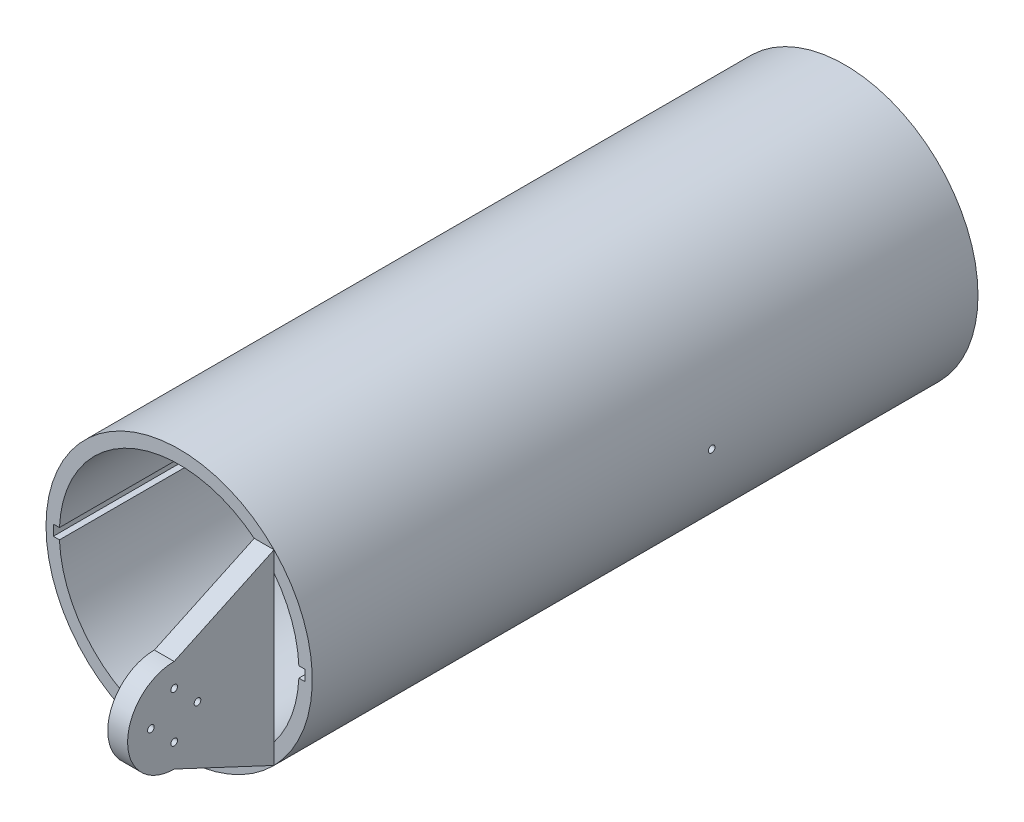
ISO-10303-21;
HEADER;
FILE_DESCRIPTION(('STEP AP214'),'2;1');
FILE_NAME('part.step','',(''),(''),'','','');
FILE_SCHEMA(('AUTOMOTIVE_DESIGN { 1 0 10303 214 1 1 1 1 }'));
ENDSEC;
DATA;
#1=APPLICATION_CONTEXT('core data for automotive mechanical design processes');
#2=APPLICATION_PROTOCOL_DEFINITION('international standard','automotive_design',2000,#1);
#3=PRODUCT_CONTEXT('',#1,'mechanical');
#4=PRODUCT('Part','Part','',(#3));
#5=PRODUCT_RELATED_PRODUCT_CATEGORY('part','',(#4));
#6=PRODUCT_DEFINITION_FORMATION('','',#4);
#7=PRODUCT_DEFINITION_CONTEXT('part definition',#1,'design');
#8=PRODUCT_DEFINITION('design','',#6,#7);
#9=PRODUCT_DEFINITION_SHAPE('','',#8);
#10=(LENGTH_UNIT() NAMED_UNIT(*) SI_UNIT(.MILLI.,.METRE.));
#11=(NAMED_UNIT(*) PLANE_ANGLE_UNIT() SI_UNIT($,.RADIAN.));
#12=(NAMED_UNIT(*) SI_UNIT($,.STERADIAN.) SOLID_ANGLE_UNIT());
#13=UNCERTAINTY_MEASURE_WITH_UNIT(LENGTH_MEASURE(1.E-05),#10,'distance_accuracy_value','');
#14=(GEOMETRIC_REPRESENTATION_CONTEXT(3) GLOBAL_UNCERTAINTY_ASSIGNED_CONTEXT((#13)) GLOBAL_UNIT_ASSIGNED_CONTEXT((#10,
#11,#12)) REPRESENTATION_CONTEXT('',''));
#15=CARTESIAN_POINT('',(0.,0.,0.));
#16=DIRECTION('',(0.,0.,1.));
#17=DIRECTION('',(1.,0.,0.));
#18=AXIS2_PLACEMENT_3D('',#15,#16,#17);
#19=CARTESIAN_POINT('',(0.,0.,250.));
#20=DIRECTION('',(0.,0.,-1.));
#21=DIRECTION('',(-1.,0.,0.));
#22=AXIS2_PLACEMENT_3D('',#19,#20,#21);
#23=CYLINDRICAL_SURFACE('',#22,50.);
#24=CARTESIAN_POINT('',(50.,0.,101.25));
#25=CARTESIAN_POINT('',(49.9999997892433,-0.0702012806053509,101.249996890468));
#26=CARTESIAN_POINT('',(49.9998505669129,-0.140453184521729,101.244066287815));
#27=CARTESIAN_POINT('',(49.9992696347054,-0.279021411192673,101.220490687249));
#28=CARTESIAN_POINT('',(49.9988375866143,-0.347335314234984,101.202831663669));
#29=CARTESIAN_POINT('',(49.9977399359377,-0.480000032970664,101.156302971443));
#30=CARTESIAN_POINT('',(49.9970744467966,-0.544352755839818,101.127438747421));
#31=CARTESIAN_POINT('',(49.9955849996606,-0.66728119145738,101.059326712717));
#32=CARTESIAN_POINT('',(49.9947610805834,-0.725858317628449,101.020081451217));
#33=CARTESIAN_POINT('',(49.9930472282989,-0.835612011829375,100.932304373999));
#34=CARTESIAN_POINT('',(49.9921572753778,-0.886786356266493,100.883769778147));
#35=CARTESIAN_POINT('',(49.9904118342181,-0.980263255157657,100.778796235128));
#36=CARTESIAN_POINT('',(49.9895563473475,-1.02256545779515,100.722356974657));
#37=CARTESIAN_POINT('',(49.9879762331022,-1.09709940400727,100.603169665472));
#38=CARTESIAN_POINT('',(49.9872516204449,-1.12933001528882,100.540420908464));
#39=CARTESIAN_POINT('',(49.9860151168566,-1.1827984149725,100.410400905536));
#40=CARTESIAN_POINT('',(49.9855032252025,-1.20403624074213,100.343129674991));
#41=CARTESIAN_POINT('',(49.9847500083149,-1.23491198038136,100.205989232804));
#42=CARTESIAN_POINT('',(49.9845086262981,-1.24455232873584,100.136120569578));
#43=CARTESIAN_POINT('',(49.9843234739843,-1.25196695086035,99.9957562161149));
#44=CARTESIAN_POINT('',(49.9843797026986,-1.24974126405586,99.925260527962));
#45=CARTESIAN_POINT('',(49.9847833781213,-1.23348907585994,99.7856597612978));
#46=CARTESIAN_POINT('',(49.9851307597476,-1.21946521174131,99.7165543755436));
#47=CARTESIAN_POINT('',(49.9860774771185,-1.18001883030617,99.5816790450587));
#48=CARTESIAN_POINT('',(49.9866768133296,-1.15459629188151,99.5159091065049));
#49=CARTESIAN_POINT('',(49.9880599499198,-1.09307119196166,99.3895631952896));
#50=CARTESIAN_POINT('',(49.988843771187,-1.0569674209775,99.3289878118357));
#51=CARTESIAN_POINT('',(49.9905074926856,-0.975105623991352,99.21475701138));
#52=CARTESIAN_POINT('',(49.9913873930577,-0.929347583862107,99.1611016045044));
#53=CARTESIAN_POINT('',(49.9931443684604,-0.829461225210461,99.0622184655441));
#54=CARTESIAN_POINT('',(49.9940214426512,-0.775330617915762,99.0169930454051));
#55=CARTESIAN_POINT('',(49.9956736570713,-0.660243785237119,98.9362714726598));
#56=CARTESIAN_POINT('',(49.9964487972851,-0.599287558820383,98.9007753215255));
#57=CARTESIAN_POINT('',(49.9978097681651,-0.472278559451485,98.8405201705382));
#58=CARTESIAN_POINT('',(49.9983955975763,-0.406225752717142,98.8157612418629));
#59=CARTESIAN_POINT('',(49.9993118852416,-0.270899185047347,98.7776848280001));
#60=CARTESIAN_POINT('',(49.9996423439818,-0.201625430244547,98.7643673210292));
#61=CARTESIAN_POINT('',(50.0000105760241,-0.0618435041436848,98.7495546188588));
#62=CARTESIAN_POINT('',(50.0000484285156,0.00866432799248807,98.7480562249943));
#63=CARTESIAN_POINT('',(49.999827390649,0.148930569407979,98.7569159498476));
#64=CARTESIAN_POINT('',(49.9995685005257,0.218688979279795,98.7672740591908));
#65=CARTESIAN_POINT('',(49.9987832089567,0.355467259085124,98.7995501119755));
#66=CARTESIAN_POINT('',(49.9982568410845,0.422487471571989,98.8214666046421));
#67=CARTESIAN_POINT('',(49.9969959169746,0.551897387208432,98.876235815335));
#68=CARTESIAN_POINT('',(49.9962613604543,0.614287084075191,98.9090885481995));
#69=CARTESIAN_POINT('',(49.9946666309293,0.732679665489656,98.9848059046364));
#70=CARTESIAN_POINT('',(49.9938064309167,0.788681172235662,99.0276726819793));
#71=CARTESIAN_POINT('',(49.9920574600653,0.892693853571702,99.1221981272366));
#72=CARTESIAN_POINT('',(49.9911686891723,0.940705013006051,99.1738568118267));
#73=CARTESIAN_POINT('',(49.9894625477771,1.02738478773992,99.2845133569773));
#74=CARTESIAN_POINT('',(49.9886451930737,1.06605133914107,99.3435128345125));
#75=CARTESIAN_POINT('',(49.9871742851885,1.13293016503026,99.467167887786));
#76=CARTESIAN_POINT('',(49.9865207316976,1.16114245925612,99.5318234528452));
#77=CARTESIAN_POINT('',(49.9854512245261,1.20630831809067,99.6649475530868));
#78=CARTESIAN_POINT('',(49.9850352425774,1.22326322223585,99.7334156335601));
#79=CARTESIAN_POINT('',(49.9844876991685,1.24543740915402,99.8722276845196));
#80=CARTESIAN_POINT('',(49.9843561376915,1.25065669262368,99.9425716548945));
#81=CARTESIAN_POINT('',(49.9843922787728,1.24921131303956,100.08311792715));
#82=CARTESIAN_POINT('',(49.9845598992096,1.242549911081,100.153320262613));
#83=CARTESIAN_POINT('',(49.985175335134,1.21753894538223,100.291609864828));
#84=CARTESIAN_POINT('',(49.98562315118,1.19918935835732,100.359697127367));
#85=CARTESIAN_POINT('',(49.986748485414,1.15132321438058,100.49182541808));
#86=CARTESIAN_POINT('',(49.9874260076321,1.12180646151248,100.555866375244));
#87=CARTESIAN_POINT('',(49.9889343430816,1.05244537142006,100.678082151641));
#88=CARTESIAN_POINT('',(49.9897651506242,1.01260141744787,100.736257188454));
#89=CARTESIAN_POINT('',(49.9914866049636,0.92370883247783,100.845103812792));
#90=CARTESIAN_POINT('',(49.992377261793,0.874658655736825,100.895774137701));
#91=CARTESIAN_POINT('',(49.994118137793,0.768733478143212,100.988174453478));
#92=CARTESIAN_POINT('',(49.9949683468844,0.711856540554558,101.02990222495));
#93=CARTESIAN_POINT('',(49.9965327264857,0.591873911934435,101.103237927888));
#94=CARTESIAN_POINT('',(49.9972468156398,0.528764529907139,101.134839814985));
#95=CARTESIAN_POINT('',(49.998456932991,0.398183073403346,101.186962967462));
#96=CARTESIAN_POINT('',(49.9989532215103,0.330716318304683,101.207497467673));
#97=CARTESIAN_POINT('',(49.999538941339,0.219018516921423,101.231451616862));
#98=CARTESIAN_POINT('',(49.9997110897919,0.175512722018037,101.238398530281));
#99=CARTESIAN_POINT('',(49.9999416851822,0.0880112516517628,101.247673696205));
#100=CARTESIAN_POINT('',(50.0000001321426,0.0440155762883697,101.250001949649));
#101=CARTESIAN_POINT('',(50.,0.,101.25));
#102=B_SPLINE_CURVE_WITH_KNOTS('',3,(#24,#25,#26,#27,#28,#29,#30,#31,#32,#33,#34,#35,#36,#37,
#38,#39,#40,#41,#42,#43,#44,#45,#46,#47,#48,#49,#50,#51,#52,#53,#54,#55,#56,#57,#58,#59,#60,#61,
#62,#63,#64,#65,#66,#67,#68,#69,#70,#71,#72,#73,#74,#75,#76,#77,#78,#79,#80,#81,#82,#83,#84,#85,
#86,#87,#88,#89,#90,#91,#92,#93,#94,#95,#96,#97,#98,#99,#100,#101),.UNSPECIFIED.,.T.,.F.,(4,2,2,
2,2,2,2,2,2,2,2,2,2,2,2,2,2,2,2,2,2,2,2,2,2,2,2,2,2,2,2,2,2,2,2,2,2,2,4),(0.,0.210443181033347,
0.421138479019948,0.631731527740004,0.842272910862806,1.05287740411288,1.26349024711038,
1.47412675962819,1.68476255612964,1.89535412929105,2.10594500275222,2.31648881487096,
2.52703301687766,2.73760106897999,2.94816942921227,3.15879545366897,3.36942150999579,
3.58004896255672,3.79067601410156,4.00124606064959,4.21181594070732,4.42235939693014,
4.63290313881923,4.84349220516216,5.05408167093516,5.26471760616385,5.47535314370606,
5.68596361286427,5.89657406951998,6.10712672521302,6.3176798003613,6.5282365696147,
6.73878552602708,6.94936986570474,7.16000640860575,7.37076845199211,7.58127789517965,
7.71322391796614,7.84516991395463),.UNSPECIFIED.);
#103=CARTESIAN_POINT('',(50.,0.,101.25));
#104=VERTEX_POINT('',#103);
#105=EDGE_CURVE('E221',#104,#104,#102,.T.);
#106=ORIENTED_EDGE('',*,*,#105,.F.);
#107=EDGE_LOOP('',(#106));
#108=FACE_BOUND('',#107,.T.);
#109=CARTESIAN_POINT('',(0.,0.,250.));
#110=DIRECTION('',(0.,0.,1.));
#111=DIRECTION('',(1.,0.,0.));
#112=AXIS2_PLACEMENT_3D('',#109,#110,#111);
#113=CIRCLE('',#112,50.);
#114=CARTESIAN_POINT('',(35.6404264845415,35.0679340708858,250.));
#115=VERTEX_POINT('',#114);
#116=CARTESIAN_POINT('',(35.6404264845415,-35.0679340708858,250.));
#117=VERTEX_POINT('',#116);
#118=EDGE_CURVE('E132',#115,#117,#113,.T.);
#119=ORIENTED_EDGE('',*,*,#118,.F.);
#120=EDGE_CURVE('E142',#117,#115,#113,.T.);
#121=ORIENTED_EDGE('',*,*,#120,.F.);
#122=EDGE_LOOP('',(#119,#121));
#123=FACE_BOUND('',#122,.T.);
#124=CARTESIAN_POINT('',(0.,0.,0.));
#125=DIRECTION('',(0.,0.,1.));
#126=DIRECTION('',(1.,0.,0.));
#127=AXIS2_PLACEMENT_3D('',#124,#125,#126);
#128=CIRCLE('',#127,50.);
#129=CARTESIAN_POINT('',(50.,0.,0.));
#130=VERTEX_POINT('',#129);
#131=EDGE_CURVE('E174',#130,#130,#128,.T.);
#132=ORIENTED_EDGE('',*,*,#131,.T.);
#133=EDGE_LOOP('',(#132));
#134=FACE_BOUND('',#133,.T.);
#135=CARTESIAN_POINT('',(-50.,0.,101.25));
#136=CARTESIAN_POINT('',(-49.9999997892433,0.0702012806053509,101.249996890468));
#137=CARTESIAN_POINT('',(-49.9998505669129,0.140453184521729,101.244066287815));
#138=CARTESIAN_POINT('',(-49.9992696347054,0.279021411192673,101.220490687249));
#139=CARTESIAN_POINT('',(-49.9988375866143,0.347335314234984,101.202831663669));
#140=CARTESIAN_POINT('',(-49.9977399359377,0.480000032970664,101.156302971443));
#141=CARTESIAN_POINT('',(-49.9970744467966,0.544352755839818,101.127438747421));
#142=CARTESIAN_POINT('',(-49.9955849996606,0.66728119145738,101.059326712717));
#143=CARTESIAN_POINT('',(-49.9947610805834,0.725858317628449,101.020081451217));
#144=CARTESIAN_POINT('',(-49.9930472282989,0.835612011829375,100.932304373999));
#145=CARTESIAN_POINT('',(-49.9921572753778,0.886786356266493,100.883769778147));
#146=CARTESIAN_POINT('',(-49.9904118342181,0.980263255157657,100.778796235128));
#147=CARTESIAN_POINT('',(-49.9895563473475,1.02256545779515,100.722356974657));
#148=CARTESIAN_POINT('',(-49.9879762331022,1.09709940400727,100.603169665472));
#149=CARTESIAN_POINT('',(-49.9872516204449,1.12933001528882,100.540420908464));
#150=CARTESIAN_POINT('',(-49.9860151168566,1.1827984149725,100.410400905536));
#151=CARTESIAN_POINT('',(-49.9855032252025,1.20403624074213,100.343129674991));
#152=CARTESIAN_POINT('',(-49.9847500083149,1.23491198038136,100.205989232804));
#153=CARTESIAN_POINT('',(-49.9845086262981,1.24455232873584,100.136120569578));
#154=CARTESIAN_POINT('',(-49.9843234739843,1.25196695086035,99.9957562161149));
#155=CARTESIAN_POINT('',(-49.9843797026986,1.24974126405586,99.925260527962));
#156=CARTESIAN_POINT('',(-49.9847833781213,1.23348907585994,99.7856597612978));
#157=CARTESIAN_POINT('',(-49.9851307597476,1.21946521174131,99.7165543755436));
#158=CARTESIAN_POINT('',(-49.9860774771185,1.18001883030617,99.5816790450587));
#159=CARTESIAN_POINT('',(-49.9866768133296,1.15459629188151,99.5159091065049));
#160=CARTESIAN_POINT('',(-49.9880599499198,1.09307119196166,99.3895631952896));
#161=CARTESIAN_POINT('',(-49.988843771187,1.0569674209775,99.3289878118357));
#162=CARTESIAN_POINT('',(-49.9905074926856,0.975105623991352,99.21475701138));
#163=CARTESIAN_POINT('',(-49.9913873930577,0.929347583862107,99.1611016045044));
#164=CARTESIAN_POINT('',(-49.9931443684604,0.829461225210461,99.0622184655441));
#165=CARTESIAN_POINT('',(-49.9940214426512,0.775330617915762,99.0169930454051));
#166=CARTESIAN_POINT('',(-49.9956736570713,0.660243785237119,98.9362714726598));
#167=CARTESIAN_POINT('',(-49.9964487972851,0.599287558820383,98.9007753215255));
#168=CARTESIAN_POINT('',(-49.9978097681651,0.472278559451485,98.8405201705382));
#169=CARTESIAN_POINT('',(-49.9983955975763,0.406225752717142,98.8157612418629));
#170=CARTESIAN_POINT('',(-49.9993118852416,0.270899185047347,98.7776848280001));
#171=CARTESIAN_POINT('',(-49.9996423439818,0.201625430244547,98.7643673210292));
#172=CARTESIAN_POINT('',(-50.0000105760241,0.0618435041436848,98.7495546188588));
#173=CARTESIAN_POINT('',(-50.0000484285156,-0.00866432799248807,98.7480562249943));
#174=CARTESIAN_POINT('',(-49.999827390649,-0.148930569407979,98.7569159498476));
#175=CARTESIAN_POINT('',(-49.9995685005257,-0.218688979279795,98.7672740591908));
#176=CARTESIAN_POINT('',(-49.9987832089567,-0.355467259085124,98.7995501119755));
#177=CARTESIAN_POINT('',(-49.9982568410845,-0.422487471571989,98.8214666046421));
#178=CARTESIAN_POINT('',(-49.9969959169746,-0.551897387208432,98.876235815335));
#179=CARTESIAN_POINT('',(-49.9962613604543,-0.614287084075191,98.9090885481995));
#180=CARTESIAN_POINT('',(-49.9946666309293,-0.732679665489656,98.9848059046364));
#181=CARTESIAN_POINT('',(-49.9938064309167,-0.788681172235662,99.0276726819793));
#182=CARTESIAN_POINT('',(-49.9920574600653,-0.892693853571702,99.1221981272366));
#183=CARTESIAN_POINT('',(-49.9911686891723,-0.940705013006051,99.1738568118267));
#184=CARTESIAN_POINT('',(-49.9894625477771,-1.02738478773992,99.2845133569773));
#185=CARTESIAN_POINT('',(-49.9886451930737,-1.06605133914107,99.3435128345125));
#186=CARTESIAN_POINT('',(-49.9871742851885,-1.13293016503026,99.467167887786));
#187=CARTESIAN_POINT('',(-49.9865207316976,-1.16114245925612,99.5318234528452));
#188=CARTESIAN_POINT('',(-49.9854512245261,-1.20630831809067,99.6649475530868));
#189=CARTESIAN_POINT('',(-49.9850352425774,-1.22326322223585,99.7334156335601));
#190=CARTESIAN_POINT('',(-49.9844876991685,-1.24543740915402,99.8722276845196));
#191=CARTESIAN_POINT('',(-49.9843561376915,-1.25065669262368,99.9425716548945));
#192=CARTESIAN_POINT('',(-49.9843922787728,-1.24921131303956,100.08311792715));
#193=CARTESIAN_POINT('',(-49.9845598992096,-1.242549911081,100.153320262613));
#194=CARTESIAN_POINT('',(-49.985175335134,-1.21753894538223,100.291609864828));
#195=CARTESIAN_POINT('',(-49.98562315118,-1.19918935835732,100.359697127367));
#196=CARTESIAN_POINT('',(-49.986748485414,-1.15132321438058,100.49182541808));
#197=CARTESIAN_POINT('',(-49.9874260076321,-1.12180646151248,100.555866375244));
#198=CARTESIAN_POINT('',(-49.9889343430816,-1.05244537142006,100.678082151641));
#199=CARTESIAN_POINT('',(-49.9897651506242,-1.01260141744787,100.736257188454));
#200=CARTESIAN_POINT('',(-49.9914866049636,-0.92370883247783,100.845103812792));
#201=CARTESIAN_POINT('',(-49.992377261793,-0.874658655736825,100.895774137701));
#202=CARTESIAN_POINT('',(-49.994118137793,-0.768733478143212,100.988174453478));
#203=CARTESIAN_POINT('',(-49.9949683468844,-0.711856540554558,101.02990222495));
#204=CARTESIAN_POINT('',(-49.9965327264857,-0.591873911934435,101.103237927888));
#205=CARTESIAN_POINT('',(-49.9972468156398,-0.528764529907139,101.134839814985));
#206=CARTESIAN_POINT('',(-49.998456932991,-0.398183073403346,101.186962967462));
#207=CARTESIAN_POINT('',(-49.9989532215103,-0.330716318304683,101.207497467673));
#208=CARTESIAN_POINT('',(-49.999538941339,-0.219018516921423,101.231451616862));
#209=CARTESIAN_POINT('',(-49.9997110897919,-0.175512722018037,101.238398530281));
#210=CARTESIAN_POINT('',(-49.9999416851822,-0.0880112516517628,101.247673696205));
#211=CARTESIAN_POINT('',(-50.0000001321426,-0.0440155762883697,101.250001949649));
#212=CARTESIAN_POINT('',(-50.,0.,101.25));
#213=B_SPLINE_CURVE_WITH_KNOTS('',3,(#135,#136,#137,#138,#139,#140,#141,#142,#143,#144,#145,
#146,#147,#148,#149,#150,#151,#152,#153,#154,#155,#156,#157,#158,#159,#160,#161,#162,#163,#164,
#165,#166,#167,#168,#169,#170,#171,#172,#173,#174,#175,#176,#177,#178,#179,#180,#181,#182,#183,
#184,#185,#186,#187,#188,#189,#190,#191,#192,#193,#194,#195,#196,#197,#198,#199,#200,#201,#202,
#203,#204,#205,#206,#207,#208,#209,#210,#211,#212),.UNSPECIFIED.,.T.,.F.,(4,2,2,2,2,2,2,2,2,2,2,
2,2,2,2,2,2,2,2,2,2,2,2,2,2,2,2,2,2,2,2,2,2,2,2,2,2,2,4),(0.,0.210443181033347,
0.421138479019948,0.631731527740004,0.842272910862806,1.05287740411288,1.26349024711038,
1.47412675962819,1.68476255612964,1.89535412929105,2.10594500275222,2.31648881487096,
2.52703301687766,2.73760106897999,2.94816942921227,3.15879545366897,3.36942150999579,
3.58004896255672,3.79067601410156,4.00124606064959,4.21181594070732,4.42235939693014,
4.63290313881923,4.84349220516216,5.05408167093516,5.26471760616385,5.47535314370606,
5.68596361286427,5.89657406951998,6.10712672521302,6.3176798003613,6.5282365696147,
6.73878552602708,6.94936986570474,7.16000640860575,7.37076845199211,7.58127789517965,
7.71322391796614,7.84516991395463),.UNSPECIFIED.);
#214=CARTESIAN_POINT('',(-50.,0.,101.25));
#215=VERTEX_POINT('',#214);
#216=EDGE_CURVE('E152',#215,#215,#213,.T.);
#217=ORIENTED_EDGE('',*,*,#216,.F.);
#218=EDGE_LOOP('',(#217));
#219=FACE_BOUND('',#218,.T.);
#220=ADVANCED_FACE('F32',(#108,#123,#134,#219),#23,.T.);
#221=CARTESIAN_POINT('',(-47.2555555555556,1.99950611185813,250.));
#222=DIRECTION('',(1.,0.,0.));
#223=DIRECTION('',(0.,0.,-1.));
#224=AXIS2_PLACEMENT_3D('',#221,#222,#223);
#225=PLANE('',#224);
#226=DIRECTION('',(0.,-1.,0.));
#227=VECTOR('',#226,1.);
#228=CARTESIAN_POINT('',(-47.2555555555556,1.99950611185813,0.));
#229=LINE('',#228,#227);
#230=CARTESIAN_POINT('',(-47.2555555555556,1.99950611185813,0.));
#231=VERTEX_POINT('',#230);
#232=CARTESIAN_POINT('',(-47.2555555555556,-1.99950611185813,0.));
#233=VERTEX_POINT('',#232);
#234=EDGE_CURVE('E510',#231,#233,#229,.T.);
#235=ORIENTED_EDGE('',*,*,#234,.F.);
#236=DIRECTION('',(0.,0.,-1.));
#237=VECTOR('',#236,1.);
#238=CARTESIAN_POINT('',(-47.2555555555556,1.99950611185813,250.));
#239=LINE('',#238,#237);
#240=CARTESIAN_POINT('',(-47.2555555555556,1.99950611185813,250.));
#241=VERTEX_POINT('',#240);
#242=EDGE_CURVE('E538',#241,#231,#239,.T.);
#243=ORIENTED_EDGE('',*,*,#242,.F.);
#244=DIRECTION('',(0.,-1.,0.));
#245=VECTOR('',#244,1.);
#246=CARTESIAN_POINT('',(-47.2555555555556,1.99950611185813,250.));
#247=LINE('',#246,#245);
#248=CARTESIAN_POINT('',(-47.2555555555556,-1.99950611185813,250.));
#249=VERTEX_POINT('',#248);
#250=EDGE_CURVE('E494',#241,#249,#247,.T.);
#251=ORIENTED_EDGE('',*,*,#250,.T.);
#252=DIRECTION('',(0.,0.,-1.));
#253=VECTOR('',#252,1.);
#254=CARTESIAN_POINT('',(-47.2555555555556,-1.99950611185813,250.));
#255=LINE('',#254,#253);
#256=EDGE_CURVE('E537',#249,#233,#255,.T.);
#257=ORIENTED_EDGE('',*,*,#256,.T.);
#258=EDGE_LOOP('',(#235,#243,#251,#257));
#259=FACE_BOUND('',#258,.T.);
#260=CARTESIAN_POINT('',(-47.2555555555556,0.,100.));
#261=DIRECTION('',(1.,0.,0.));
#262=DIRECTION('',(0.,0.,-1.));
#263=AXIS2_PLACEMENT_3D('',#260,#261,#262);
#264=CIRCLE('',#263,1.25);
#265=CARTESIAN_POINT('',(-47.2555555555556,0.,98.75));
#266=VERTEX_POINT('',#265);
#267=EDGE_CURVE('E184',#266,#266,#264,.F.);
#268=ORIENTED_EDGE('',*,*,#267,.T.);
#269=EDGE_LOOP('',(#268));
#270=FACE_BOUND('',#269,.T.);
#271=ADVANCED_FACE('F258',(#259,#270),#225,.T.);
#272=CARTESIAN_POINT('',(47.2555555555554,1.99950611185836,250.));
#273=DIRECTION('',(-1.,0.,0.));
#274=DIRECTION('',(0.,-1.,0.));
#275=AXIS2_PLACEMENT_3D('',#272,#273,#274);
#276=PLANE('',#275);
#277=DIRECTION('',(0.,1.,0.));
#278=VECTOR('',#277,1.);
#279=CARTESIAN_POINT('',(47.2555555555554,1.99950611185836,0.));
#280=LINE('',#279,#278);
#281=CARTESIAN_POINT('',(47.2555555555555,-1.99950611185791,0.));
#282=VERTEX_POINT('',#281);
#283=CARTESIAN_POINT('',(47.2555555555554,1.99950611185836,0.));
#284=VERTEX_POINT('',#283);
#285=EDGE_CURVE('E522',#282,#284,#280,.T.);
#286=ORIENTED_EDGE('',*,*,#285,.F.);
#287=DIRECTION('',(0.,0.,-1.));
#288=VECTOR('',#287,1.);
#289=CARTESIAN_POINT('',(47.2555555555555,-1.99950611185791,250.));
#290=LINE('',#289,#288);
#291=CARTESIAN_POINT('',(47.2555555555555,-1.99950611185791,250.));
#292=VERTEX_POINT('',#291);
#293=EDGE_CURVE('E531',#292,#282,#290,.T.);
#294=ORIENTED_EDGE('',*,*,#293,.F.);
#295=DIRECTION('',(0.,1.,0.));
#296=VECTOR('',#295,1.);
#297=CARTESIAN_POINT('',(47.2555555555554,1.99950611185836,250.));
#298=LINE('',#297,#296);
#299=CARTESIAN_POINT('',(47.2555555555554,1.99950611185836,250.));
#300=VERTEX_POINT('',#299);
#301=EDGE_CURVE('E503',#292,#300,#298,.T.);
#302=ORIENTED_EDGE('',*,*,#301,.T.);
#303=DIRECTION('',(0.,0.,-1.));
#304=VECTOR('',#303,1.);
#305=CARTESIAN_POINT('',(47.2555555555554,1.99950611185836,250.));
#306=LINE('',#305,#304);
#307=EDGE_CURVE('E57',#300,#284,#306,.T.);
#308=ORIENTED_EDGE('',*,*,#307,.T.);
#309=EDGE_LOOP('',(#286,#294,#302,#308));
#310=FACE_BOUND('',#309,.T.);
#311=CARTESIAN_POINT('',(47.2555555555555,0.,100.));
#312=DIRECTION('',(-1.,0.,0.));
#313=DIRECTION('',(0.,-1.,0.));
#314=AXIS2_PLACEMENT_3D('',#311,#312,#313);
#315=CIRCLE('',#314,1.25);
#316=CARTESIAN_POINT('',(47.2555555555555,-1.25,100.));
#317=VERTEX_POINT('',#316);
#318=EDGE_CURVE('E181',#317,#317,#315,.F.);
#319=ORIENTED_EDGE('',*,*,#318,.T.);
#320=EDGE_LOOP('',(#319));
#321=FACE_BOUND('',#320,.T.);
#322=ADVANCED_FACE('F255',(#310,#321),#276,.T.);
#323=CARTESIAN_POINT('',(0.,0.,250.));
#324=DIRECTION('',(0.,0.,1.));
#325=DIRECTION('',(1.,0.,0.));
#326=AXIS2_PLACEMENT_3D('',#323,#324,#325);
#327=PLANE('',#326);
#328=DIRECTION('',(1.,0.,0.));
#329=VECTOR('',#328,1.);
#330=CARTESIAN_POINT('',(35.6404264845415,-35.0679340708858,250.));
#331=LINE('',#330,#329);
#332=CARTESIAN_POINT('',(28.2,-35.0679340708858,250.));
#333=VERTEX_POINT('',#332);
#334=EDGE_CURVE('E136',#333,#117,#331,.T.);
#335=ORIENTED_EDGE('',*,*,#334,.F.);
#336=CARTESIAN_POINT('',(0.,0.,250.));
#337=DIRECTION('',(0.,0.,1.));
#338=DIRECTION('',(1.,0.,0.));
#339=AXIS2_PLACEMENT_3D('',#336,#337,#338);
#340=CIRCLE('',#339,45.);
#341=CARTESIAN_POINT('',(-44.9555555555556,-1.99950611185813,250.));
#342=VERTEX_POINT('',#341);
#343=EDGE_CURVE('E498',#342,#333,#340,.T.);
#344=ORIENTED_EDGE('',*,*,#343,.F.);
#345=DIRECTION('',(1.,0.,0.));
#346=VECTOR('',#345,1.);
#347=CARTESIAN_POINT('',(-44.9555555555556,-1.99950611185813,250.));
#348=LINE('',#347,#346);
#349=EDGE_CURVE('E496',#249,#342,#348,.T.);
#350=ORIENTED_EDGE('',*,*,#349,.F.);
#351=ORIENTED_EDGE('',*,*,#250,.F.);
#352=DIRECTION('',(-1.,0.,0.));
#353=VECTOR('',#352,1.);
#354=CARTESIAN_POINT('',(-44.9555555555556,1.99950611185813,250.));
#355=LINE('',#354,#353);
#356=CARTESIAN_POINT('',(-44.9555555555556,1.99950611185813,250.));
#357=VERTEX_POINT('',#356);
#358=EDGE_CURVE('E490',#357,#241,#355,.T.);
#359=ORIENTED_EDGE('',*,*,#358,.F.);
#360=CARTESIAN_POINT('',(0.,0.,250.));
#361=DIRECTION('',(0.,0.,1.));
#362=DIRECTION('',(1.,0.,0.));
#363=AXIS2_PLACEMENT_3D('',#360,#361,#362);
#364=CIRCLE('',#363,45.);
#365=CARTESIAN_POINT('',(28.2,35.0679340708858,250.));
#366=VERTEX_POINT('',#365);
#367=EDGE_CURVE('E492',#366,#357,#364,.T.);
#368=ORIENTED_EDGE('',*,*,#367,.F.);
#369=DIRECTION('',(-1.,0.,0.));
#370=VECTOR('',#369,1.);
#371=CARTESIAN_POINT('',(28.2,35.0679340708858,250.));
#372=LINE('',#371,#370);
#373=EDGE_CURVE('E139',#115,#366,#372,.T.);
#374=ORIENTED_EDGE('',*,*,#373,.F.);
#375=ORIENTED_EDGE('',*,*,#118,.T.);
#376=EDGE_LOOP('',(#335,#344,#350,#351,#359,#368,#374,#375));
#377=FACE_BOUND('',#376,.T.);
#378=ADVANCED_FACE('F134',(#377),#327,.T.);
#379=DIRECTION('',(0.,1.,0.));
#380=VECTOR('',#379,1.);
#381=CARTESIAN_POINT('',(35.6404264845415,35.0679340708858,250.));
#382=LINE('',#381,#380);
#383=CARTESIAN_POINT('',(35.6404264845415,-27.4728957337954,250.));
#384=VERTEX_POINT('',#383);
#385=EDGE_CURVE('E159',#117,#384,#382,.T.);
#386=ORIENTED_EDGE('',*,*,#385,.F.);
#387=ORIENTED_EDGE('',*,*,#120,.T.);
#388=CARTESIAN_POINT('',(35.6404264845415,27.4728957337954,250.));
#389=VERTEX_POINT('',#388);
#390=EDGE_CURVE('E49',#389,#115,#382,.T.);
#391=ORIENTED_EDGE('',*,*,#390,.F.);
#392=CARTESIAN_POINT('',(44.9555555555554,1.99950611185834,250.));
#393=VERTEX_POINT('',#392);
#394=EDGE_CURVE('E488',#393,#389,#364,.T.);
#395=ORIENTED_EDGE('',*,*,#394,.F.);
#396=DIRECTION('',(-1.,0.,0.));
#397=VECTOR('',#396,1.);
#398=CARTESIAN_POINT('',(44.9555555555554,1.99950611185834,250.));
#399=LINE('',#398,#397);
#400=EDGE_CURVE('E505',#300,#393,#399,.T.);
#401=ORIENTED_EDGE('',*,*,#400,.F.);
#402=ORIENTED_EDGE('',*,*,#301,.F.);
#403=DIRECTION('',(1.,0.,0.));
#404=VECTOR('',#403,1.);
#405=CARTESIAN_POINT('',(44.9555555555555,-1.99950611185793,250.));
#406=LINE('',#405,#404);
#407=CARTESIAN_POINT('',(44.9555555555555,-1.99950611185793,250.));
#408=VERTEX_POINT('',#407);
#409=EDGE_CURVE('E500',#408,#292,#406,.T.);
#410=ORIENTED_EDGE('',*,*,#409,.F.);
#411=EDGE_CURVE('E170',#384,#408,#340,.T.);
#412=ORIENTED_EDGE('',*,*,#411,.F.);
#413=EDGE_LOOP('',(#386,#387,#391,#395,#401,#402,#410,#412));
#414=FACE_BOUND('',#413,.T.);
#415=ADVANCED_FACE('F168',(#414),#327,.T.);
#416=CARTESIAN_POINT('',(0.,0.,0.));
#417=DIRECTION('',(0.,0.,1.));
#418=DIRECTION('',(1.,0.,0.));
#419=AXIS2_PLACEMENT_3D('',#416,#417,#418);
#420=PLANE('',#419);
#421=ORIENTED_EDGE('',*,*,#131,.F.);
#422=EDGE_LOOP('',(#421));
#423=FACE_BOUND('',#422,.T.);
#424=CARTESIAN_POINT('',(0.,0.,0.));
#425=DIRECTION('',(0.,0.,1.));
#426=DIRECTION('',(1.,0.,0.));
#427=AXIS2_PLACEMENT_3D('',#424,#425,#426);
#428=CIRCLE('',#427,45.);
#429=CARTESIAN_POINT('',(44.9555555555554,1.99950611185834,0.));
#430=VERTEX_POINT('',#429);
#431=CARTESIAN_POINT('',(-44.9555555555556,1.99950611185813,0.));
#432=VERTEX_POINT('',#431);
#433=EDGE_CURVE('E481',#430,#432,#428,.T.);
#434=ORIENTED_EDGE('',*,*,#433,.T.);
#435=DIRECTION('',(-1.,0.,0.));
#436=VECTOR('',#435,1.);
#437=CARTESIAN_POINT('',(-44.9555555555556,1.99950611185813,0.));
#438=LINE('',#437,#436);
#439=EDGE_CURVE('E484',#432,#231,#438,.T.);
#440=ORIENTED_EDGE('',*,*,#439,.T.);
#441=ORIENTED_EDGE('',*,*,#234,.T.);
#442=DIRECTION('',(1.,0.,0.));
#443=VECTOR('',#442,1.);
#444=CARTESIAN_POINT('',(-44.9555555555556,-1.99950611185813,0.));
#445=LINE('',#444,#443);
#446=CARTESIAN_POINT('',(-44.9555555555556,-1.99950611185813,0.));
#447=VERTEX_POINT('',#446);
#448=EDGE_CURVE('E513',#233,#447,#445,.T.);
#449=ORIENTED_EDGE('',*,*,#448,.T.);
#450=CARTESIAN_POINT('',(0.,0.,0.));
#451=DIRECTION('',(0.,0.,1.));
#452=DIRECTION('',(1.,0.,0.));
#453=AXIS2_PLACEMENT_3D('',#450,#451,#452);
#454=CIRCLE('',#453,45.);
#455=CARTESIAN_POINT('',(44.9555555555555,-1.99950611185793,0.));
#456=VERTEX_POINT('',#455);
#457=EDGE_CURVE('E516',#447,#456,#454,.T.);
#458=ORIENTED_EDGE('',*,*,#457,.T.);
#459=DIRECTION('',(1.,0.,0.));
#460=VECTOR('',#459,1.);
#461=CARTESIAN_POINT('',(44.9555555555555,-1.99950611185793,0.));
#462=LINE('',#461,#460);
#463=EDGE_CURVE('E519',#456,#282,#462,.T.);
#464=ORIENTED_EDGE('',*,*,#463,.T.);
#465=ORIENTED_EDGE('',*,*,#285,.T.);
#466=DIRECTION('',(-1.,0.,0.));
#467=VECTOR('',#466,1.);
#468=CARTESIAN_POINT('',(44.9555555555554,1.99950611185834,0.));
#469=LINE('',#468,#467);
#470=EDGE_CURVE('E525',#284,#430,#469,.T.);
#471=ORIENTED_EDGE('',*,*,#470,.T.);
#472=EDGE_LOOP('',(#434,#440,#441,#449,#458,#464,#465,#471));
#473=FACE_BOUND('',#472,.T.);
#474=ADVANCED_FACE('F281',(#423,#473),#420,.F.);
#475=CARTESIAN_POINT('',(0.,0.,250.));
#476=DIRECTION('',(0.,0.,-1.));
#477=DIRECTION('',(-1.,0.,0.));
#478=AXIS2_PLACEMENT_3D('',#475,#476,#477);
#479=CYLINDRICAL_SURFACE('',#478,45.);
#480=ORIENTED_EDGE('',*,*,#433,.F.);
#481=DIRECTION('',(0.,0.,-1.));
#482=VECTOR('',#481,1.);
#483=CARTESIAN_POINT('',(44.9555555555554,1.99950611185834,250.));
#484=LINE('',#483,#482);
#485=EDGE_CURVE('E506',#393,#430,#484,.T.);
#486=ORIENTED_EDGE('',*,*,#485,.F.);
#487=ORIENTED_EDGE('',*,*,#394,.T.);
#488=EDGE_CURVE('E491',#389,#366,#364,.T.);
#489=ORIENTED_EDGE('',*,*,#488,.T.);
#490=ORIENTED_EDGE('',*,*,#367,.T.);
#491=DIRECTION('',(0.,0.,-1.));
#492=VECTOR('',#491,1.);
#493=CARTESIAN_POINT('',(-44.9555555555556,1.99950611185813,250.));
#494=LINE('',#493,#492);
#495=EDGE_CURVE('E176',#357,#432,#494,.T.);
#496=ORIENTED_EDGE('',*,*,#495,.T.);
#497=EDGE_LOOP('',(#480,#486,#487,#489,#490,#496));
#498=FACE_BOUND('',#497,.T.);
#499=ADVANCED_FACE('F277',(#498),#479,.F.);
#500=CARTESIAN_POINT('',(-44.9555555555556,1.99950611185813,250.));
#501=DIRECTION('',(0.,-1.,0.));
#502=DIRECTION('',(0.,0.,-1.));
#503=AXIS2_PLACEMENT_3D('',#500,#501,#502);
#504=PLANE('',#503);
#505=ORIENTED_EDGE('',*,*,#439,.F.);
#506=ORIENTED_EDGE('',*,*,#495,.F.);
#507=ORIENTED_EDGE('',*,*,#358,.T.);
#508=ORIENTED_EDGE('',*,*,#242,.T.);
#509=EDGE_LOOP('',(#505,#506,#507,#508));
#510=FACE_BOUND('',#509,.T.);
#511=ADVANCED_FACE('F270',(#510),#504,.T.);
#512=CARTESIAN_POINT('',(-44.9555555555556,-1.99950611185813,250.));
#513=DIRECTION('',(0.,1.,0.));
#514=DIRECTION('',(0.,0.,1.));
#515=AXIS2_PLACEMENT_3D('',#512,#513,#514);
#516=PLANE('',#515);
#517=ORIENTED_EDGE('',*,*,#448,.F.);
#518=ORIENTED_EDGE('',*,*,#256,.F.);
#519=ORIENTED_EDGE('',*,*,#349,.T.);
#520=DIRECTION('',(0.,0.,-1.));
#521=VECTOR('',#520,1.);
#522=CARTESIAN_POINT('',(-44.9555555555556,-1.99950611185813,250.));
#523=LINE('',#522,#521);
#524=EDGE_CURVE('E535',#342,#447,#523,.T.);
#525=ORIENTED_EDGE('',*,*,#524,.T.);
#526=EDGE_LOOP('',(#517,#518,#519,#525));
#527=FACE_BOUND('',#526,.T.);
#528=ADVANCED_FACE('F266',(#527),#516,.T.);
#529=CARTESIAN_POINT('',(0.,0.,250.));
#530=DIRECTION('',(0.,0.,-1.));
#531=DIRECTION('',(-1.,0.,0.));
#532=AXIS2_PLACEMENT_3D('',#529,#530,#531);
#533=CYLINDRICAL_SURFACE('',#532,45.);
#534=ORIENTED_EDGE('',*,*,#457,.F.);
#535=ORIENTED_EDGE('',*,*,#524,.F.);
#536=ORIENTED_EDGE('',*,*,#343,.T.);
#537=EDGE_CURVE('E501',#333,#384,#340,.T.);
#538=ORIENTED_EDGE('',*,*,#537,.T.);
#539=ORIENTED_EDGE('',*,*,#411,.T.);
#540=DIRECTION('',(0.,0.,-1.));
#541=VECTOR('',#540,1.);
#542=CARTESIAN_POINT('',(44.9555555555555,-1.99950611185793,250.));
#543=LINE('',#542,#541);
#544=EDGE_CURVE('E533',#408,#456,#543,.T.);
#545=ORIENTED_EDGE('',*,*,#544,.T.);
#546=EDGE_LOOP('',(#534,#535,#536,#538,#539,#545));
#547=FACE_BOUND('',#546,.T.);
#548=ADVANCED_FACE('F262',(#547),#533,.F.);
#549=CARTESIAN_POINT('',(44.9555555555555,-1.99950611185793,250.));
#550=DIRECTION('',(0.,1.,0.));
#551=DIRECTION('',(-1.,0.,0.));
#552=AXIS2_PLACEMENT_3D('',#549,#550,#551);
#553=PLANE('',#552);
#554=ORIENTED_EDGE('',*,*,#463,.F.);
#555=ORIENTED_EDGE('',*,*,#544,.F.);
#556=ORIENTED_EDGE('',*,*,#409,.T.);
#557=ORIENTED_EDGE('',*,*,#293,.T.);
#558=EDGE_LOOP('',(#554,#555,#556,#557));
#559=FACE_BOUND('',#558,.T.);
#560=ADVANCED_FACE('F254',(#559),#553,.T.);
#561=CARTESIAN_POINT('',(44.9555555555554,1.99950611185834,250.));
#562=DIRECTION('',(0.,-1.,0.));
#563=DIRECTION('',(1.,0.,0.));
#564=AXIS2_PLACEMENT_3D('',#561,#562,#563);
#565=PLANE('',#564);
#566=ORIENTED_EDGE('',*,*,#470,.F.);
#567=ORIENTED_EDGE('',*,*,#307,.F.);
#568=ORIENTED_EDGE('',*,*,#400,.T.);
#569=ORIENTED_EDGE('',*,*,#485,.T.);
#570=EDGE_LOOP('',(#566,#567,#568,#569));
#571=FACE_BOUND('',#570,.T.);
#572=ADVANCED_FACE('F243',(#571),#565,.T.);
#573=CARTESIAN_POINT('',(0.,0.,250.));
#574=DIRECTION('',(0.,0.,-1.));
#575=DIRECTION('',(-1.,0.,0.));
#576=AXIS2_PLACEMENT_3D('',#573,#574,#575);
#577=PLANE('',#576);
#578=ORIENTED_EDGE('',*,*,#488,.F.);
#579=EDGE_CURVE('E151',#384,#389,#382,.T.);
#580=ORIENTED_EDGE('',*,*,#579,.F.);
#581=ORIENTED_EDGE('',*,*,#537,.F.);
#582=DIRECTION('',(0.,-1.,0.));
#583=VECTOR('',#582,1.);
#584=CARTESIAN_POINT('',(28.2,0.,250.));
#585=LINE('',#584,#583);
#586=EDGE_CURVE('E479',#366,#333,#585,.T.);
#587=ORIENTED_EDGE('',*,*,#586,.F.);
#588=EDGE_LOOP('',(#578,#580,#581,#587));
#589=FACE_BOUND('',#588,.T.);
#590=ADVANCED_FACE('F239',(#589),#577,.T.);
#591=CARTESIAN_POINT('',(35.6404264845415,35.0679340708858,305.));
#592=DIRECTION('',(-1.,0.,0.));
#593=DIRECTION('',(0.,0.,1.));
#594=AXIS2_PLACEMENT_3D('',#591,#592,#593);
#595=PLANE('',#594);
#596=CARTESIAN_POINT('',(35.6404264845415,-8.75,287.5));
#597=DIRECTION('',(1.,0.,0.));
#598=DIRECTION('',(0.,0.,-1.));
#599=AXIS2_PLACEMENT_3D('',#596,#597,#598);
#600=CIRCLE('',#599,1.25000000000001);
#601=CARTESIAN_POINT('',(35.6404264845415,-8.75,286.25));
#602=VERTEX_POINT('',#601);
#603=EDGE_CURVE('E206',#602,#602,#600,.T.);
#604=ORIENTED_EDGE('',*,*,#603,.F.);
#605=EDGE_LOOP('',(#604));
#606=FACE_BOUND('',#605,.T.);
#607=CARTESIAN_POINT('',(35.6404264845415,0.,278.75));
#608=DIRECTION('',(1.,0.,0.));
#609=DIRECTION('',(0.,0.,-1.));
#610=AXIS2_PLACEMENT_3D('',#607,#608,#609);
#611=CIRCLE('',#610,1.25000000000001);
#612=CARTESIAN_POINT('',(35.6404264845415,0.,277.5));
#613=VERTEX_POINT('',#612);
#614=EDGE_CURVE('E196',#613,#613,#611,.T.);
#615=ORIENTED_EDGE('',*,*,#614,.F.);
#616=EDGE_LOOP('',(#615));
#617=FACE_BOUND('',#616,.T.);
#618=CARTESIAN_POINT('',(35.6404264845415,8.75,287.5));
#619=DIRECTION('',(1.,0.,0.));
#620=DIRECTION('',(0.,0.,-1.));
#621=AXIS2_PLACEMENT_3D('',#618,#619,#620);
#622=CIRCLE('',#621,1.25000000000001);
#623=CARTESIAN_POINT('',(35.6404264845415,8.75,286.25));
#624=VERTEX_POINT('',#623);
#625=EDGE_CURVE('E193',#624,#624,#622,.T.);
#626=ORIENTED_EDGE('',*,*,#625,.F.);
#627=EDGE_LOOP('',(#626));
#628=FACE_BOUND('',#627,.T.);
#629=CARTESIAN_POINT('',(35.6404264845415,0.,296.25));
#630=DIRECTION('',(1.,0.,0.));
#631=DIRECTION('',(0.,0.,-1.));
#632=AXIS2_PLACEMENT_3D('',#629,#630,#631);
#633=CIRCLE('',#632,1.25000000000001);
#634=CARTESIAN_POINT('',(35.6404264845415,0.,295.));
#635=VERTEX_POINT('',#634);
#636=EDGE_CURVE('E190',#635,#635,#633,.T.);
#637=ORIENTED_EDGE('',*,*,#636,.F.);
#638=EDGE_LOOP('',(#637));
#639=FACE_BOUND('',#638,.T.);
#640=CARTESIAN_POINT('',(35.6404264845415,0.,287.5));
#641=DIRECTION('',(-1.,0.,0.));
#642=DIRECTION('',(0.,0.,-1.));
#643=AXIS2_PLACEMENT_3D('',#640,#641,#642);
#644=CIRCLE('',#643,17.5);
#645=CARTESIAN_POINT('',(35.6404264845415,-17.5,287.5));
#646=VERTEX_POINT('',#645);
#647=CARTESIAN_POINT('',(35.6404264845415,17.5,287.5));
#648=VERTEX_POINT('',#647);
#649=EDGE_CURVE('E162',#646,#648,#644,.T.);
#650=ORIENTED_EDGE('',*,*,#649,.F.);
#651=DIRECTION('',(0.,0.424232106125961,0.905553488277711));
#652=VECTOR('',#651,1.);
#653=CARTESIAN_POINT('',(35.6404264845415,-17.5,287.5));
#654=LINE('',#653,#652);
#655=EDGE_CURVE('E150',#117,#646,#654,.T.);
#656=ORIENTED_EDGE('',*,*,#655,.F.);
#657=ORIENTED_EDGE('',*,*,#385,.T.);
#658=ORIENTED_EDGE('',*,*,#579,.T.);
#659=ORIENTED_EDGE('',*,*,#390,.T.);
#660=DIRECTION('',(0.,0.424232106125961,-0.905553488277711));
#661=VECTOR('',#660,1.);
#662=CARTESIAN_POINT('',(35.6404264845415,17.5,287.5));
#663=LINE('',#662,#661);
#664=EDGE_CURVE('E213',#648,#115,#663,.T.);
#665=ORIENTED_EDGE('',*,*,#664,.F.);
#666=EDGE_LOOP('',(#650,#656,#657,#658,#659,#665));
#667=FACE_BOUND('',#666,.T.);
#668=ADVANCED_FACE('F157',(#606,#617,#628,#639,#667),#595,.F.);
#669=CARTESIAN_POINT('',(28.2,0.,305.));
#670=DIRECTION('',(1.,0.,0.));
#671=DIRECTION('',(0.,0.,-1.));
#672=AXIS2_PLACEMENT_3D('',#669,#670,#671);
#673=PLANE('',#672);
#674=CARTESIAN_POINT('',(28.2,-8.75,287.5));
#675=DIRECTION('',(1.,0.,0.));
#676=DIRECTION('',(0.,0.,-1.));
#677=AXIS2_PLACEMENT_3D('',#674,#675,#676);
#678=CIRCLE('',#677,1.25000000000001);
#679=CARTESIAN_POINT('',(28.2,-8.75,286.25));
#680=VERTEX_POINT('',#679);
#681=EDGE_CURVE('E36',#680,#680,#678,.T.);
#682=ORIENTED_EDGE('',*,*,#681,.T.);
#683=EDGE_LOOP('',(#682));
#684=FACE_BOUND('',#683,.T.);
#685=CARTESIAN_POINT('',(28.2,0.,278.75));
#686=DIRECTION('',(1.,0.,0.));
#687=DIRECTION('',(0.,0.,-1.));
#688=AXIS2_PLACEMENT_3D('',#685,#686,#687);
#689=CIRCLE('',#688,1.25000000000001);
#690=CARTESIAN_POINT('',(28.2,0.,277.5));
#691=VERTEX_POINT('',#690);
#692=EDGE_CURVE('E194',#691,#691,#689,.T.);
#693=ORIENTED_EDGE('',*,*,#692,.T.);
#694=EDGE_LOOP('',(#693));
#695=FACE_BOUND('',#694,.T.);
#696=CARTESIAN_POINT('',(28.2,8.75,287.5));
#697=DIRECTION('',(1.,0.,0.));
#698=DIRECTION('',(0.,0.,-1.));
#699=AXIS2_PLACEMENT_3D('',#696,#697,#698);
#700=CIRCLE('',#699,1.25000000000001);
#701=CARTESIAN_POINT('',(28.2,8.75,286.25));
#702=VERTEX_POINT('',#701);
#703=EDGE_CURVE('E191',#702,#702,#700,.T.);
#704=ORIENTED_EDGE('',*,*,#703,.T.);
#705=EDGE_LOOP('',(#704));
#706=FACE_BOUND('',#705,.T.);
#707=CARTESIAN_POINT('',(28.2,0.,296.25));
#708=DIRECTION('',(1.,0.,0.));
#709=DIRECTION('',(0.,0.,-1.));
#710=AXIS2_PLACEMENT_3D('',#707,#708,#709);
#711=CIRCLE('',#710,1.25000000000001);
#712=CARTESIAN_POINT('',(28.2,0.,295.));
#713=VERTEX_POINT('',#712);
#714=EDGE_CURVE('E165',#713,#713,#711,.T.);
#715=ORIENTED_EDGE('',*,*,#714,.T.);
#716=EDGE_LOOP('',(#715));
#717=FACE_BOUND('',#716,.T.);
#718=DIRECTION('',(0.,0.424232106125961,0.905553488277711));
#719=VECTOR('',#718,1.);
#720=CARTESIAN_POINT('',(28.2,-7.62758949032791,308.57335971429));
#721=LINE('',#720,#719);
#722=CARTESIAN_POINT('',(28.2,-17.5,287.5));
#723=VERTEX_POINT('',#722);
#724=EDGE_CURVE('E11',#333,#723,#721,.T.);
#725=ORIENTED_EDGE('',*,*,#724,.T.);
#726=CARTESIAN_POINT('',(28.2,0.,287.5));
#727=DIRECTION('',(1.,0.,0.));
#728=DIRECTION('',(0.,0.,-1.));
#729=AXIS2_PLACEMENT_3D('',#726,#727,#728);
#730=CIRCLE('',#729,17.5);
#731=CARTESIAN_POINT('',(28.2,17.5,287.5));
#732=VERTEX_POINT('',#731);
#733=EDGE_CURVE('E185',#723,#732,#730,.F.);
#734=ORIENTED_EDGE('',*,*,#733,.T.);
#735=DIRECTION('',(0.,0.424232106125961,-0.905553488277711));
#736=VECTOR('',#735,1.);
#737=CARTESIAN_POINT('',(28.2,7.62758949032791,308.57335971429));
#738=LINE('',#737,#736);
#739=EDGE_CURVE('E41',#732,#366,#738,.T.);
#740=ORIENTED_EDGE('',*,*,#739,.T.);
#741=ORIENTED_EDGE('',*,*,#586,.T.);
#742=EDGE_LOOP('',(#725,#734,#740,#741));
#743=FACE_BOUND('',#742,.T.);
#744=ADVANCED_FACE('F245',(#684,#695,#706,#717,#743),#673,.F.);
#745=CARTESIAN_POINT('',(110.640426484541,0.,100.));
#746=DIRECTION('',(-1.,0.,0.));
#747=DIRECTION('',(0.,0.,1.));
#748=AXIS2_PLACEMENT_3D('',#745,#746,#747);
#749=CYLINDRICAL_SURFACE('',#748,1.25);
#750=ORIENTED_EDGE('',*,*,#318,.F.);
#751=EDGE_LOOP('',(#750));
#752=FACE_BOUND('',#751,.T.);
#753=ORIENTED_EDGE('',*,*,#105,.T.);
#754=EDGE_LOOP('',(#753));
#755=FACE_BOUND('',#754,.T.);
#756=ADVANCED_FACE('F235',(#752,#755),#749,.F.);
#757=ORIENTED_EDGE('',*,*,#267,.F.);
#758=EDGE_LOOP('',(#757));
#759=FACE_BOUND('',#758,.T.);
#760=ORIENTED_EDGE('',*,*,#216,.T.);
#761=EDGE_LOOP('',(#760));
#762=FACE_BOUND('',#761,.T.);
#763=ADVANCED_FACE('F229',(#759,#762),#749,.F.);
#764=CARTESIAN_POINT('',(-60.3595735154585,17.5,287.5));
#765=DIRECTION('',(0.,-0.905553488277711,-0.424232106125961));
#766=DIRECTION('',(0.,0.424232106125961,-0.905553488277711));
#767=AXIS2_PLACEMENT_3D('',#764,#765,#766);
#768=PLANE('',#767);
#769=DIRECTION('',(1.,0.,0.));
#770=VECTOR('',#769,1.);
#771=CARTESIAN_POINT('',(-60.3595735154585,17.5,287.5));
#772=LINE('',#771,#770);
#773=EDGE_CURVE('E215',#732,#648,#772,.T.);
#774=ORIENTED_EDGE('',*,*,#773,.T.);
#775=ORIENTED_EDGE('',*,*,#664,.T.);
#776=ORIENTED_EDGE('',*,*,#373,.T.);
#777=ORIENTED_EDGE('',*,*,#739,.F.);
#778=EDGE_LOOP('',(#774,#775,#776,#777));
#779=FACE_BOUND('',#778,.T.);
#780=ADVANCED_FACE('F234',(#779),#768,.F.);
#781=CARTESIAN_POINT('',(-60.3595735154585,0.,287.5));
#782=DIRECTION('',(1.,0.,0.));
#783=DIRECTION('',(0.,0.,-1.));
#784=AXIS2_PLACEMENT_3D('',#781,#782,#783);
#785=CYLINDRICAL_SURFACE('',#784,17.5);
#786=ORIENTED_EDGE('',*,*,#733,.F.);
#787=DIRECTION('',(1.,0.,0.));
#788=VECTOR('',#787,1.);
#789=CARTESIAN_POINT('',(-60.3595735154585,-17.5,287.5));
#790=LINE('',#789,#788);
#791=EDGE_CURVE('E164',#723,#646,#790,.T.);
#792=ORIENTED_EDGE('',*,*,#791,.T.);
#793=ORIENTED_EDGE('',*,*,#649,.T.);
#794=ORIENTED_EDGE('',*,*,#773,.F.);
#795=EDGE_LOOP('',(#786,#792,#793,#794));
#796=FACE_BOUND('',#795,.T.);
#797=ADVANCED_FACE('F237',(#796),#785,.T.);
#798=CARTESIAN_POINT('',(-60.3595735154585,-17.5,287.5));
#799=DIRECTION('',(0.,0.905553488277711,-0.424232106125961));
#800=DIRECTION('',(0.,0.424232106125961,0.905553488277711));
#801=AXIS2_PLACEMENT_3D('',#798,#799,#800);
#802=PLANE('',#801);
#803=ORIENTED_EDGE('',*,*,#334,.T.);
#804=ORIENTED_EDGE('',*,*,#655,.T.);
#805=ORIENTED_EDGE('',*,*,#791,.F.);
#806=ORIENTED_EDGE('',*,*,#724,.F.);
#807=EDGE_LOOP('',(#803,#804,#805,#806));
#808=FACE_BOUND('',#807,.T.);
#809=ADVANCED_FACE('F148',(#808),#802,.F.);
#810=CARTESIAN_POINT('',(-60.3595735154585,0.,296.25));
#811=DIRECTION('',(1.,0.,0.));
#812=DIRECTION('',(0.,0.,-1.));
#813=AXIS2_PLACEMENT_3D('',#810,#811,#812);
#814=CYLINDRICAL_SURFACE('',#813,1.25000000000001);
#815=ORIENTED_EDGE('',*,*,#636,.T.);
#816=EDGE_LOOP('',(#815));
#817=FACE_BOUND('',#816,.T.);
#818=ORIENTED_EDGE('',*,*,#714,.F.);
#819=EDGE_LOOP('',(#818));
#820=FACE_BOUND('',#819,.T.);
#821=ADVANCED_FACE('F329',(#817,#820),#814,.F.);
#822=CARTESIAN_POINT('',(-60.3595735154585,8.75,287.5));
#823=DIRECTION('',(1.,0.,0.));
#824=DIRECTION('',(0.,0.,-1.));
#825=AXIS2_PLACEMENT_3D('',#822,#823,#824);
#826=CYLINDRICAL_SURFACE('',#825,1.25000000000001);
#827=ORIENTED_EDGE('',*,*,#625,.T.);
#828=EDGE_LOOP('',(#827));
#829=FACE_BOUND('',#828,.T.);
#830=ORIENTED_EDGE('',*,*,#703,.F.);
#831=EDGE_LOOP('',(#830));
#832=FACE_BOUND('',#831,.T.);
#833=ADVANCED_FACE('F337',(#829,#832),#826,.F.);
#834=CARTESIAN_POINT('',(-60.3595735154585,0.,278.75));
#835=DIRECTION('',(1.,0.,0.));
#836=DIRECTION('',(0.,0.,-1.));
#837=AXIS2_PLACEMENT_3D('',#834,#835,#836);
#838=CYLINDRICAL_SURFACE('',#837,1.25000000000001);
#839=ORIENTED_EDGE('',*,*,#614,.T.);
#840=EDGE_LOOP('',(#839));
#841=FACE_BOUND('',#840,.T.);
#842=ORIENTED_EDGE('',*,*,#692,.F.);
#843=EDGE_LOOP('',(#842));
#844=FACE_BOUND('',#843,.T.);
#845=ADVANCED_FACE('F345',(#841,#844),#838,.F.);
#846=CARTESIAN_POINT('',(-60.3595735154585,-8.75,287.5));
#847=DIRECTION('',(1.,0.,0.));
#848=DIRECTION('',(0.,0.,-1.));
#849=AXIS2_PLACEMENT_3D('',#846,#847,#848);
#850=CYLINDRICAL_SURFACE('',#849,1.25000000000001);
#851=ORIENTED_EDGE('',*,*,#603,.T.);
#852=EDGE_LOOP('',(#851));
#853=FACE_BOUND('',#852,.T.);
#854=ORIENTED_EDGE('',*,*,#681,.F.);
#855=EDGE_LOOP('',(#854));
#856=FACE_BOUND('',#855,.T.);
#857=ADVANCED_FACE('F353',(#853,#856),#850,.F.);
#858=CLOSED_SHELL('',(#220,#271,#322,#378,#415,#474,#499,#511,#528,#548,#560,#572,#590,#668,
#744,#756,#763,#780,#797,#809,#821,#833,#845,#857));
#859=MANIFOLD_SOLID_BREP('B2',#858);
#860=ADVANCED_BREP_SHAPE_REPRESENTATION('',(#18,#859),#14);
#861=SHAPE_DEFINITION_REPRESENTATION(#9,#860);
ENDSEC;
END-ISO-10303-21;
